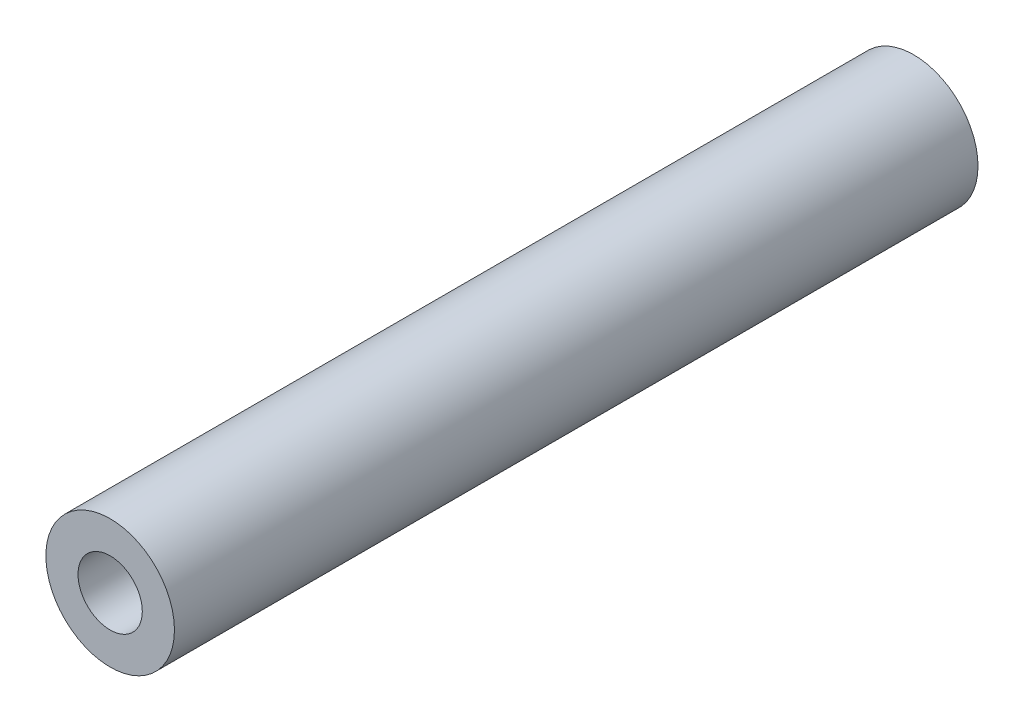
ISO-10303-21;
HEADER;
FILE_DESCRIPTION(('STEP AP214'),'2;1');
FILE_NAME('part.step','',(''),(''),'','','');
FILE_SCHEMA(('AUTOMOTIVE_DESIGN { 1 0 10303 214 1 1 1 1 }'));
ENDSEC;
DATA;
#1=APPLICATION_CONTEXT('core data for automotive mechanical design processes');
#2=APPLICATION_PROTOCOL_DEFINITION('international standard','automotive_design',2000,#1);
#3=PRODUCT_CONTEXT('',#1,'mechanical');
#4=PRODUCT('Part','Part','',(#3));
#5=PRODUCT_RELATED_PRODUCT_CATEGORY('part','',(#4));
#6=PRODUCT_DEFINITION_FORMATION('','',#4);
#7=PRODUCT_DEFINITION_CONTEXT('part definition',#1,'design');
#8=PRODUCT_DEFINITION('design','',#6,#7);
#9=PRODUCT_DEFINITION_SHAPE('','',#8);
#10=(LENGTH_UNIT() NAMED_UNIT(*) SI_UNIT(.MILLI.,.METRE.));
#11=(NAMED_UNIT(*) PLANE_ANGLE_UNIT() SI_UNIT($,.RADIAN.));
#12=(NAMED_UNIT(*) SI_UNIT($,.STERADIAN.) SOLID_ANGLE_UNIT());
#13=UNCERTAINTY_MEASURE_WITH_UNIT(LENGTH_MEASURE(1.E-05),#10,'distance_accuracy_value','');
#14=(GEOMETRIC_REPRESENTATION_CONTEXT(3) GLOBAL_UNCERTAINTY_ASSIGNED_CONTEXT((#13)) GLOBAL_UNIT_ASSIGNED_CONTEXT((#10,
#11,#12)) REPRESENTATION_CONTEXT('',''));
#15=CARTESIAN_POINT('',(0.,0.,0.));
#16=DIRECTION('',(0.,0.,1.));
#17=DIRECTION('',(1.,0.,0.));
#18=AXIS2_PLACEMENT_3D('',#15,#16,#17);
#19=CARTESIAN_POINT('',(0.,0.,12.5));
#20=DIRECTION('',(0.,0.,1.));
#21=DIRECTION('',(1.,0.,0.));
#22=AXIS2_PLACEMENT_3D('',#19,#20,#21);
#23=PLANE('',#22);
#24=CARTESIAN_POINT('',(0.,0.,12.5));
#25=DIRECTION('',(0.,0.,1.));
#26=DIRECTION('',(1.,0.,0.));
#27=AXIS2_PLACEMENT_3D('',#24,#25,#26);
#28=CIRCLE('',#27,2.);
#29=CARTESIAN_POINT('',(2.,0.,12.5));
#30=VERTEX_POINT('',#29);
#31=EDGE_CURVE('E10',#30,#30,#28,.T.);
#32=ORIENTED_EDGE('',*,*,#31,.T.);
#33=EDGE_LOOP('',(#32));
#34=FACE_BOUND('',#33,.T.);
#35=CARTESIAN_POINT('',(0.,0.,12.5));
#36=DIRECTION('',(0.,0.,1.));
#37=DIRECTION('',(1.,0.,0.));
#38=AXIS2_PLACEMENT_3D('',#35,#36,#37);
#39=CIRCLE('',#38,1.);
#40=CARTESIAN_POINT('',(1.,0.,12.5));
#41=VERTEX_POINT('',#40);
#42=EDGE_CURVE('E42',#41,#41,#39,.T.);
#43=ORIENTED_EDGE('',*,*,#42,.F.);
#44=EDGE_LOOP('',(#43));
#45=FACE_BOUND('',#44,.T.);
#46=ADVANCED_FACE('F31',(#34,#45),#23,.T.);
#47=CARTESIAN_POINT('',(0.,0.,-12.5));
#48=DIRECTION('',(0.,0.,1.));
#49=DIRECTION('',(1.,0.,0.));
#50=AXIS2_PLACEMENT_3D('',#47,#48,#49);
#51=PLANE('',#50);
#52=CARTESIAN_POINT('',(0.,0.,-12.5));
#53=DIRECTION('',(0.,0.,1.));
#54=DIRECTION('',(1.,0.,0.));
#55=AXIS2_PLACEMENT_3D('',#52,#53,#54);
#56=CIRCLE('',#55,2.);
#57=CARTESIAN_POINT('',(2.,0.,-12.5));
#58=VERTEX_POINT('',#57);
#59=EDGE_CURVE('E35',#58,#58,#56,.T.);
#60=ORIENTED_EDGE('',*,*,#59,.F.);
#61=EDGE_LOOP('',(#60));
#62=FACE_BOUND('',#61,.T.);
#63=CARTESIAN_POINT('',(0.,0.,-12.5));
#64=DIRECTION('',(0.,0.,1.));
#65=DIRECTION('',(1.,0.,0.));
#66=AXIS2_PLACEMENT_3D('',#63,#64,#65);
#67=CIRCLE('',#66,1.);
#68=CARTESIAN_POINT('',(1.,0.,-12.5));
#69=VERTEX_POINT('',#68);
#70=EDGE_CURVE('E44',#69,#69,#67,.T.);
#71=ORIENTED_EDGE('',*,*,#70,.T.);
#72=EDGE_LOOP('',(#71));
#73=FACE_BOUND('',#72,.T.);
#74=ADVANCED_FACE('F54',(#62,#73),#51,.F.);
#75=CARTESIAN_POINT('',(0.,0.,12.5));
#76=DIRECTION('',(0.,0.,-1.));
#77=DIRECTION('',(-1.,0.,0.));
#78=AXIS2_PLACEMENT_3D('',#75,#76,#77);
#79=CYLINDRICAL_SURFACE('',#78,2.);
#80=ORIENTED_EDGE('',*,*,#31,.F.);
#81=EDGE_LOOP('',(#80));
#82=FACE_BOUND('',#81,.T.);
#83=ORIENTED_EDGE('',*,*,#59,.T.);
#84=EDGE_LOOP('',(#83));
#85=FACE_BOUND('',#84,.T.);
#86=ADVANCED_FACE('F33',(#82,#85),#79,.T.);
#87=CARTESIAN_POINT('',(0.,0.,12.5));
#88=DIRECTION('',(0.,0.,-1.));
#89=DIRECTION('',(-1.,0.,0.));
#90=AXIS2_PLACEMENT_3D('',#87,#88,#89);
#91=CYLINDRICAL_SURFACE('',#90,1.);
#92=ORIENTED_EDGE('',*,*,#42,.T.);
#93=EDGE_LOOP('',(#92));
#94=FACE_BOUND('',#93,.T.);
#95=ORIENTED_EDGE('',*,*,#70,.F.);
#96=EDGE_LOOP('',(#95));
#97=FACE_BOUND('',#96,.T.);
#98=ADVANCED_FACE('F50',(#94,#97),#91,.F.);
#99=CLOSED_SHELL('',(#46,#74,#86,#98));
#100=MANIFOLD_SOLID_BREP('B2',#99);
#101=ADVANCED_BREP_SHAPE_REPRESENTATION('',(#18,#100),#14);
#102=SHAPE_DEFINITION_REPRESENTATION(#9,#101);
ENDSEC;
END-ISO-10303-21;
